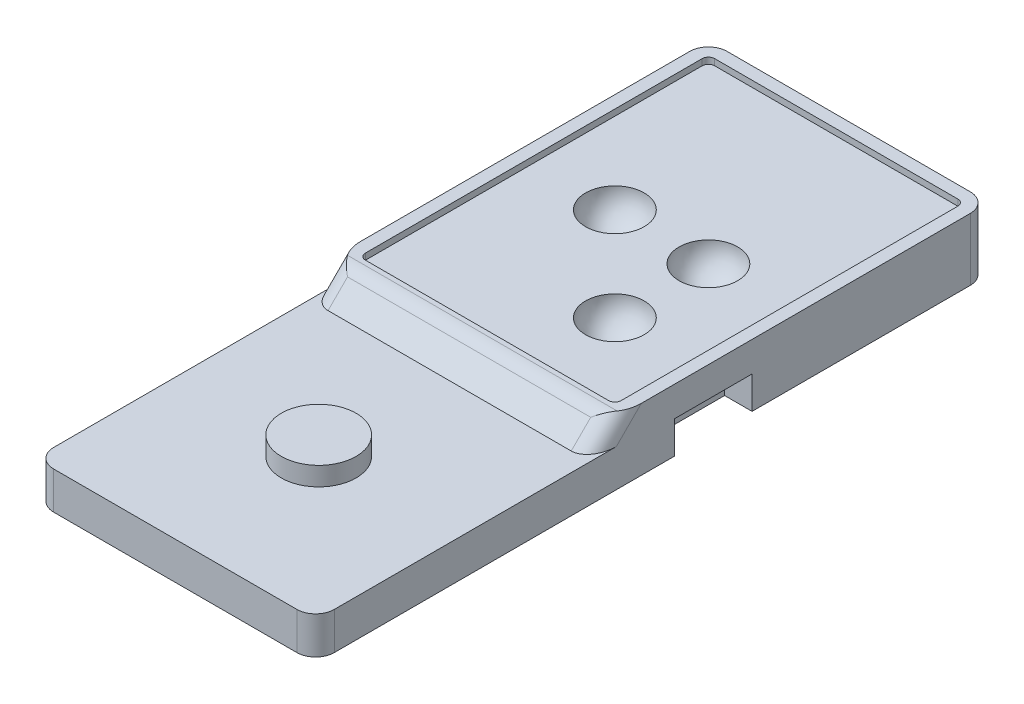
ISO-10303-21;
HEADER;
FILE_DESCRIPTION(('STEP AP214'),'2;1');
FILE_NAME('part.step','',(''),(''),'','','');
FILE_SCHEMA(('AUTOMOTIVE_DESIGN { 1 0 10303 214 1 1 1 1 }'));
ENDSEC;
DATA;
#1=APPLICATION_CONTEXT('core data for automotive mechanical design processes');
#2=APPLICATION_PROTOCOL_DEFINITION('international standard','automotive_design',2000,#1);
#3=PRODUCT_CONTEXT('',#1,'mechanical');
#4=PRODUCT('Part','Part','',(#3));
#5=PRODUCT_RELATED_PRODUCT_CATEGORY('part','',(#4));
#6=PRODUCT_DEFINITION_FORMATION('','',#4);
#7=PRODUCT_DEFINITION_CONTEXT('part definition',#1,'design');
#8=PRODUCT_DEFINITION('design','',#6,#7);
#9=PRODUCT_DEFINITION_SHAPE('','',#8);
#10=(LENGTH_UNIT() NAMED_UNIT(*) SI_UNIT(.MILLI.,.METRE.));
#11=(NAMED_UNIT(*) PLANE_ANGLE_UNIT() SI_UNIT($,.RADIAN.));
#12=(NAMED_UNIT(*) SI_UNIT($,.STERADIAN.) SOLID_ANGLE_UNIT());
#13=UNCERTAINTY_MEASURE_WITH_UNIT(LENGTH_MEASURE(1.E-05),#10,'distance_accuracy_value','');
#14=(GEOMETRIC_REPRESENTATION_CONTEXT(3) GLOBAL_UNCERTAINTY_ASSIGNED_CONTEXT((#13)) GLOBAL_UNIT_ASSIGNED_CONTEXT((#10,
#11,#12)) REPRESENTATION_CONTEXT('',''));
#15=CARTESIAN_POINT('',(0.,0.,0.));
#16=DIRECTION('',(0.,0.,1.));
#17=DIRECTION('',(1.,0.,0.));
#18=AXIS2_PLACEMENT_3D('',#15,#16,#17);
#19=CARTESIAN_POINT('',(-12.4,-4.5,0.));
#20=DIRECTION('',(-1.,0.,0.));
#21=DIRECTION('',(0.,0.,1.));
#22=AXIS2_PLACEMENT_3D('',#19,#20,#21);
#23=PLANE('',#22);
#24=DIRECTION('',(0.,0.,1.));
#25=VECTOR('',#24,1.);
#26=CARTESIAN_POINT('',(-12.4,-1.5,15.));
#27=LINE('',#26,#25);
#28=CARTESIAN_POINT('',(-12.4,-1.5,14.8786796564404));
#29=VERTEX_POINT('',#28);
#30=CARTESIAN_POINT('',(-12.4,-1.5,37.5));
#31=VERTEX_POINT('',#30);
#32=EDGE_CURVE('E412',#29,#31,#27,.T.);
#33=ORIENTED_EDGE('',*,*,#32,.F.);
#34=DIRECTION('',(0.,0.707106781186547,-0.707106781186549));
#35=VECTOR('',#34,1.);
#36=CARTESIAN_POINT('',(-12.4,4.43933982822018,8.93933982822016));
#37=LINE('',#36,#35);
#38=CARTESIAN_POINT('',(-12.4,0.5,12.8786796564404));
#39=VERTEX_POINT('',#38);
#40=EDGE_CURVE('E253',#29,#39,#37,.T.);
#41=ORIENTED_EDGE('',*,*,#40,.T.);
#42=DIRECTION('',(0.,0.,-1.));
#43=VECTOR('',#42,1.);
#44=CARTESIAN_POINT('',(-12.4,0.5,15.));
#45=LINE('',#44,#43);
#46=CARTESIAN_POINT('',(-12.4,0.5,-13.5));
#47=VERTEX_POINT('',#46);
#48=EDGE_CURVE('E321',#39,#47,#45,.T.);
#49=ORIENTED_EDGE('',*,*,#48,.T.);
#50=DIRECTION('',(0.,1.,0.));
#51=VECTOR('',#50,1.);
#52=CARTESIAN_POINT('',(-12.4,-4.5,-13.5));
#53=LINE('',#52,#51);
#54=CARTESIAN_POINT('',(-12.4,-4.5,-13.5));
#55=VERTEX_POINT('',#54);
#56=EDGE_CURVE('E454',#47,#55,#53,.F.);
#57=ORIENTED_EDGE('',*,*,#56,.T.);
#58=DIRECTION('',(0.,0.,1.));
#59=VECTOR('',#58,1.);
#60=CARTESIAN_POINT('',(-12.4,-4.5,0.));
#61=LINE('',#60,#59);
#62=CARTESIAN_POINT('',(-12.4,-4.5,4.));
#63=VERTEX_POINT('',#62);
#64=EDGE_CURVE('E425',#55,#63,#61,.T.);
#65=ORIENTED_EDGE('',*,*,#64,.T.);
#66=DIRECTION('',(0.,-1.,0.));
#67=VECTOR('',#66,1.);
#68=CARTESIAN_POINT('',(-12.4,-1.9,4.));
#69=LINE('',#68,#67);
#70=CARTESIAN_POINT('',(-12.4,-1.9,4.));
#71=VERTEX_POINT('',#70);
#72=EDGE_CURVE('E366',#71,#63,#69,.T.);
#73=ORIENTED_EDGE('',*,*,#72,.F.);
#74=DIRECTION('',(0.,0.,1.));
#75=VECTOR('',#74,1.);
#76=CARTESIAN_POINT('',(-12.4,-1.9,10.2));
#77=LINE('',#76,#75);
#78=CARTESIAN_POINT('',(-12.4,-1.9,10.2));
#79=VERTEX_POINT('',#78);
#80=EDGE_CURVE('E356',#71,#79,#77,.T.);
#81=ORIENTED_EDGE('',*,*,#80,.T.);
#82=DIRECTION('',(0.,-1.,0.));
#83=VECTOR('',#82,1.);
#84=CARTESIAN_POINT('',(-12.4,-1.9,10.2));
#85=LINE('',#84,#83);
#86=CARTESIAN_POINT('',(-12.4,-4.5,10.2));
#87=VERTEX_POINT('',#86);
#88=EDGE_CURVE('E374',#79,#87,#85,.T.);
#89=ORIENTED_EDGE('',*,*,#88,.T.);
#90=CARTESIAN_POINT('',(-12.4,-4.5,37.5));
#91=VERTEX_POINT('',#90);
#92=EDGE_CURVE('E424',#87,#91,#61,.T.);
#93=ORIENTED_EDGE('',*,*,#92,.T.);
#94=DIRECTION('',(0.,-1.,0.));
#95=VECTOR('',#94,1.);
#96=CARTESIAN_POINT('',(-12.4,-1.5,37.5));
#97=LINE('',#96,#95);
#98=EDGE_CURVE('E451',#91,#31,#97,.F.);
#99=ORIENTED_EDGE('',*,*,#98,.T.);
#100=EDGE_LOOP('',(#33,#41,#49,#57,#65,#73,#81,#89,#93,#99));
#101=FACE_BOUND('',#100,.T.);
#102=ADVANCED_FACE('F37',(#101),#23,.T.);
#103=CARTESIAN_POINT('',(0.,-4.5,0.));
#104=DIRECTION('',(0.,1.,0.));
#105=DIRECTION('',(0.,0.,1.));
#106=AXIS2_PLACEMENT_3D('',#103,#104,#105);
#107=PLANE('',#106);
#108=DIRECTION('',(1.,0.,0.));
#109=VECTOR('',#108,1.);
#110=CARTESIAN_POINT('',(-10.2,-4.5,10.2));
#111=LINE('',#110,#109);
#112=CARTESIAN_POINT('',(-10.2,-4.5,10.2));
#113=VERTEX_POINT('',#112);
#114=EDGE_CURVE('E360',#87,#113,#111,.T.);
#115=ORIENTED_EDGE('',*,*,#114,.T.);
#116=DIRECTION('',(0.,0.,-1.));
#117=VECTOR('',#116,1.);
#118=CARTESIAN_POINT('',(-10.2,-4.5,10.2));
#119=LINE('',#118,#117);
#120=CARTESIAN_POINT('',(-10.2,-4.5,4.));
#121=VERTEX_POINT('',#120);
#122=EDGE_CURVE('E369',#113,#121,#119,.T.);
#123=ORIENTED_EDGE('',*,*,#122,.T.);
#124=DIRECTION('',(-1.,0.,0.));
#125=VECTOR('',#124,1.);
#126=CARTESIAN_POINT('',(-10.2,-4.5,4.));
#127=LINE('',#126,#125);
#128=EDGE_CURVE('E355',#121,#63,#127,.T.);
#129=ORIENTED_EDGE('',*,*,#128,.T.);
#130=ORIENTED_EDGE('',*,*,#64,.F.);
#131=CARTESIAN_POINT('',(-10.9,-4.5,-13.5));
#132=DIRECTION('',(0.,1.,0.));
#133=DIRECTION('',(0.,0.,1.));
#134=AXIS2_PLACEMENT_3D('',#131,#132,#133);
#135=CIRCLE('',#134,1.5);
#136=CARTESIAN_POINT('',(-10.9,-4.5,-15.));
#137=VERTEX_POINT('',#136);
#138=EDGE_CURVE('E446',#55,#137,#135,.F.);
#139=ORIENTED_EDGE('',*,*,#138,.T.);
#140=DIRECTION('',(1.,0.,0.));
#141=VECTOR('',#140,1.);
#142=CARTESIAN_POINT('',(0.,-4.5,-15.));
#143=LINE('',#142,#141);
#144=CARTESIAN_POINT('',(8.6,-4.5,-15.));
#145=VERTEX_POINT('',#144);
#146=EDGE_CURVE('E419',#137,#145,#143,.T.);
#147=ORIENTED_EDGE('',*,*,#146,.T.);
#148=CARTESIAN_POINT('',(8.6,-4.5,-13.5));
#149=DIRECTION('',(0.,1.,0.));
#150=DIRECTION('',(0.,0.,1.));
#151=AXIS2_PLACEMENT_3D('',#148,#149,#150);
#152=CIRCLE('',#151,1.5);
#153=CARTESIAN_POINT('',(10.1,-4.5,-13.5));
#154=VERTEX_POINT('',#153);
#155=EDGE_CURVE('E448',#145,#154,#152,.F.);
#156=ORIENTED_EDGE('',*,*,#155,.T.);
#157=DIRECTION('',(0.,0.,-1.));
#158=VECTOR('',#157,1.);
#159=CARTESIAN_POINT('',(10.1,-4.5,0.));
#160=LINE('',#159,#158);
#161=CARTESIAN_POINT('',(10.1,-4.5,4.));
#162=VERTEX_POINT('',#161);
#163=EDGE_CURVE('E428',#162,#154,#160,.T.);
#164=ORIENTED_EDGE('',*,*,#163,.F.);
#165=DIRECTION('',(1.,0.,0.));
#166=VECTOR('',#165,1.);
#167=CARTESIAN_POINT('',(7.9,-4.5,4.));
#168=LINE('',#167,#166);
#169=CARTESIAN_POINT('',(7.9,-4.5,4.));
#170=VERTEX_POINT('',#169);
#171=EDGE_CURVE('E387',#170,#162,#168,.T.);
#172=ORIENTED_EDGE('',*,*,#171,.F.);
#173=DIRECTION('',(0.,0.,-1.));
#174=VECTOR('',#173,1.);
#175=CARTESIAN_POINT('',(7.9,-4.5,10.2));
#176=LINE('',#175,#174);
#177=CARTESIAN_POINT('',(7.9,-4.5,10.2));
#178=VERTEX_POINT('',#177);
#179=EDGE_CURVE('E399',#178,#170,#176,.T.);
#180=ORIENTED_EDGE('',*,*,#179,.F.);
#181=DIRECTION('',(-1.,0.,0.));
#182=VECTOR('',#181,1.);
#183=CARTESIAN_POINT('',(7.9,-4.5,10.2));
#184=LINE('',#183,#182);
#185=CARTESIAN_POINT('',(10.1,-4.5,10.2));
#186=VERTEX_POINT('',#185);
#187=EDGE_CURVE('E377',#186,#178,#184,.T.);
#188=ORIENTED_EDGE('',*,*,#187,.F.);
#189=CARTESIAN_POINT('',(10.1,-4.5,37.5));
#190=VERTEX_POINT('',#189);
#191=EDGE_CURVE('E429',#190,#186,#160,.T.);
#192=ORIENTED_EDGE('',*,*,#191,.F.);
#193=CARTESIAN_POINT('',(8.6,-4.5,37.5));
#194=DIRECTION('',(0.,1.,0.));
#195=DIRECTION('',(0.,0.,1.));
#196=AXIS2_PLACEMENT_3D('',#193,#194,#195);
#197=CIRCLE('',#196,1.5);
#198=CARTESIAN_POINT('',(8.6,-4.5,39.));
#199=VERTEX_POINT('',#198);
#200=EDGE_CURVE('E444',#190,#199,#197,.F.);
#201=ORIENTED_EDGE('',*,*,#200,.T.);
#202=DIRECTION('',(1.,0.,0.));
#203=VECTOR('',#202,1.);
#204=CARTESIAN_POINT('',(-12.4,-4.5,39.));
#205=LINE('',#204,#203);
#206=CARTESIAN_POINT('',(-10.9,-4.5,39.));
#207=VERTEX_POINT('',#206);
#208=EDGE_CURVE('E406',#207,#199,#205,.T.);
#209=ORIENTED_EDGE('',*,*,#208,.F.);
#210=CARTESIAN_POINT('',(-10.9,-4.5,37.5));
#211=DIRECTION('',(0.,1.,0.));
#212=DIRECTION('',(0.,0.,1.));
#213=AXIS2_PLACEMENT_3D('',#210,#211,#212);
#214=CIRCLE('',#213,1.5);
#215=EDGE_CURVE('E441',#207,#91,#214,.F.);
#216=ORIENTED_EDGE('',*,*,#215,.T.);
#217=ORIENTED_EDGE('',*,*,#92,.F.);
#218=EDGE_LOOP('',(#115,#123,#129,#130,#139,#147,#156,#164,#172,#180,#188,#192,#201,#209,#216,#217));
#219=FACE_BOUND('',#218,.T.);
#220=ADVANCED_FACE('F489',(#219),#107,.F.);
#221=CARTESIAN_POINT('',(0.,-4.5,-15.));
#222=DIRECTION('',(0.,0.,1.));
#223=DIRECTION('',(1.,0.,0.));
#224=AXIS2_PLACEMENT_3D('',#221,#222,#223);
#225=PLANE('',#224);
#226=DIRECTION('',(0.,1.,0.));
#227=VECTOR('',#226,1.);
#228=CARTESIAN_POINT('',(-10.9,0.,-15.));
#229=LINE('',#228,#227);
#230=CARTESIAN_POINT('',(-10.9,0.5,-15.));
#231=VERTEX_POINT('',#230);
#232=EDGE_CURVE('E437',#137,#231,#229,.T.);
#233=ORIENTED_EDGE('',*,*,#232,.T.);
#234=DIRECTION('',(1.,0.,0.));
#235=VECTOR('',#234,1.);
#236=CARTESIAN_POINT('',(8.6,0.5,-15.));
#237=LINE('',#236,#235);
#238=CARTESIAN_POINT('',(8.6,0.5,-15.));
#239=VERTEX_POINT('',#238);
#240=EDGE_CURVE('E315',#231,#239,#237,.T.);
#241=ORIENTED_EDGE('',*,*,#240,.T.);
#242=DIRECTION('',(0.,1.,0.));
#243=VECTOR('',#242,1.);
#244=CARTESIAN_POINT('',(8.6,-4.5,-15.));
#245=LINE('',#244,#243);
#246=EDGE_CURVE('E439',#239,#145,#245,.F.);
#247=ORIENTED_EDGE('',*,*,#246,.T.);
#248=ORIENTED_EDGE('',*,*,#146,.F.);
#249=EDGE_LOOP('',(#233,#241,#247,#248));
#250=FACE_BOUND('',#249,.T.);
#251=ADVANCED_FACE('F486',(#250),#225,.F.);
#252=CARTESIAN_POINT('',(10.1,-4.5,0.));
#253=DIRECTION('',(1.,0.,0.));
#254=DIRECTION('',(0.,0.,-1.));
#255=AXIS2_PLACEMENT_3D('',#252,#253,#254);
#256=PLANE('',#255);
#257=DIRECTION('',(0.,0.,1.));
#258=VECTOR('',#257,1.);
#259=CARTESIAN_POINT('',(10.1,0.5,15.));
#260=LINE('',#259,#258);
#261=CARTESIAN_POINT('',(10.1,0.5,-13.5));
#262=VERTEX_POINT('',#261);
#263=CARTESIAN_POINT('',(10.1,0.5,12.8786796564404));
#264=VERTEX_POINT('',#263);
#265=EDGE_CURVE('E309',#262,#264,#260,.T.);
#266=ORIENTED_EDGE('',*,*,#265,.T.);
#267=DIRECTION('',(0.,0.707106781186547,-0.707106781186549));
#268=VECTOR('',#267,1.);
#269=CARTESIAN_POINT('',(10.1,4.43933982822018,8.93933982822016));
#270=LINE('',#269,#268);
#271=CARTESIAN_POINT('',(10.1,-1.5,14.8786796564404));
#272=VERTEX_POINT('',#271);
#273=EDGE_CURVE('E251',#264,#272,#270,.F.);
#274=ORIENTED_EDGE('',*,*,#273,.T.);
#275=DIRECTION('',(0.,0.,-1.));
#276=VECTOR('',#275,1.);
#277=CARTESIAN_POINT('',(10.1,-1.5,15.));
#278=LINE('',#277,#276);
#279=CARTESIAN_POINT('',(10.1,-1.5,37.5));
#280=VERTEX_POINT('',#279);
#281=EDGE_CURVE('E417',#280,#272,#278,.T.);
#282=ORIENTED_EDGE('',*,*,#281,.F.);
#283=DIRECTION('',(0.,-1.,0.));
#284=VECTOR('',#283,1.);
#285=CARTESIAN_POINT('',(10.1,-4.5,37.5));
#286=LINE('',#285,#284);
#287=EDGE_CURVE('E432',#280,#190,#286,.T.);
#288=ORIENTED_EDGE('',*,*,#287,.T.);
#289=ORIENTED_EDGE('',*,*,#191,.T.);
#290=DIRECTION('',(0.,-1.,0.));
#291=VECTOR('',#290,1.);
#292=CARTESIAN_POINT('',(10.1,-1.9,10.2));
#293=LINE('',#292,#291);
#294=CARTESIAN_POINT('',(10.1,-1.9,10.2));
#295=VERTEX_POINT('',#294);
#296=EDGE_CURVE('E396',#295,#186,#293,.T.);
#297=ORIENTED_EDGE('',*,*,#296,.F.);
#298=DIRECTION('',(0.,0.,1.));
#299=VECTOR('',#298,1.);
#300=CARTESIAN_POINT('',(10.1,-1.9,10.2));
#301=LINE('',#300,#299);
#302=CARTESIAN_POINT('',(10.1,-1.9,4.));
#303=VERTEX_POINT('',#302);
#304=EDGE_CURVE('E383',#303,#295,#301,.T.);
#305=ORIENTED_EDGE('',*,*,#304,.F.);
#306=DIRECTION('',(0.,-1.,0.));
#307=VECTOR('',#306,1.);
#308=CARTESIAN_POINT('',(10.1,-1.9,4.));
#309=LINE('',#308,#307);
#310=EDGE_CURVE('E403',#303,#162,#309,.T.);
#311=ORIENTED_EDGE('',*,*,#310,.T.);
#312=ORIENTED_EDGE('',*,*,#163,.T.);
#313=DIRECTION('',(0.,1.,0.));
#314=VECTOR('',#313,1.);
#315=CARTESIAN_POINT('',(10.1,0.,-13.5));
#316=LINE('',#315,#314);
#317=EDGE_CURVE('E435',#154,#262,#316,.T.);
#318=ORIENTED_EDGE('',*,*,#317,.T.);
#319=EDGE_LOOP('',(#266,#274,#282,#288,#289,#297,#305,#311,#312,#318));
#320=FACE_BOUND('',#319,.T.);
#321=ADVANCED_FACE('F477',(#320),#256,.T.);
#322=CARTESIAN_POINT('',(0.,0.,0.));
#323=DIRECTION('',(0.,1.,0.));
#324=DIRECTION('',(0.,0.,1.));
#325=AXIS2_PLACEMENT_3D('',#322,#323,#324);
#326=PLANE('',#325);
#327=CARTESIAN_POINT('',(2.6,0.,0.));
#328=DIRECTION('',(0.,1.,0.));
#329=DIRECTION('',(0.,0.,1.));
#330=AXIS2_PLACEMENT_3D('',#327,#328,#329);
#331=CIRCLE('',#330,2.35);
#332=CARTESIAN_POINT('',(2.6,0.,2.35));
#333=VERTEX_POINT('',#332);
#334=EDGE_CURVE('E41',#333,#333,#331,.T.);
#335=ORIENTED_EDGE('',*,*,#334,.F.);
#336=EDGE_LOOP('',(#335));
#337=FACE_BOUND('',#336,.T.);
#338=CARTESIAN_POINT('',(2.6,0.,7.5));
#339=DIRECTION('',(0.,1.,0.));
#340=DIRECTION('',(0.,0.,1.));
#341=AXIS2_PLACEMENT_3D('',#338,#339,#340);
#342=CIRCLE('',#341,2.35);
#343=CARTESIAN_POINT('',(2.6,0.,9.85));
#344=VERTEX_POINT('',#343);
#345=EDGE_CURVE('E284',#344,#344,#342,.T.);
#346=ORIENTED_EDGE('',*,*,#345,.F.);
#347=EDGE_LOOP('',(#346));
#348=FACE_BOUND('',#347,.T.);
#349=CARTESIAN_POINT('',(-4.89999999999999,0.,0.));
#350=DIRECTION('',(0.,1.,0.));
#351=DIRECTION('',(0.,0.,1.));
#352=AXIS2_PLACEMENT_3D('',#349,#350,#351);
#353=CIRCLE('',#352,2.35);
#354=CARTESIAN_POINT('',(-4.89999999999999,0.,2.35));
#355=VERTEX_POINT('',#354);
#356=EDGE_CURVE('E245',#355,#355,#353,.T.);
#357=ORIENTED_EDGE('',*,*,#356,.F.);
#358=EDGE_LOOP('',(#357));
#359=FACE_BOUND('',#358,.T.);
#360=DIRECTION('',(0.,0.,-1.));
#361=VECTOR('',#360,1.);
#362=CARTESIAN_POINT('',(-11.4,0.,15.));
#363=LINE('',#362,#361);
#364=CARTESIAN_POINT('',(-11.4,0.,13.5));
#365=VERTEX_POINT('',#364);
#366=CARTESIAN_POINT('',(-11.4,0.,-13.5));
#367=VERTEX_POINT('',#366);
#368=EDGE_CURVE('E334',#365,#367,#363,.T.);
#369=ORIENTED_EDGE('',*,*,#368,.F.);
#370=CARTESIAN_POINT('',(-10.9,0.,13.5));
#371=DIRECTION('',(0.,1.,0.));
#372=DIRECTION('',(0.,0.,1.));
#373=AXIS2_PLACEMENT_3D('',#370,#371,#372);
#374=CIRCLE('',#373,0.5);
#375=CARTESIAN_POINT('',(-10.9,0.,14.));
#376=VERTEX_POINT('',#375);
#377=EDGE_CURVE('E271',#365,#376,#374,.T.);
#378=ORIENTED_EDGE('',*,*,#377,.T.);
#379=DIRECTION('',(-1.,0.,0.));
#380=VECTOR('',#379,1.);
#381=CARTESIAN_POINT('',(0.,0.,14.));
#382=LINE('',#381,#380);
#383=CARTESIAN_POINT('',(8.6,0.,14.));
#384=VERTEX_POINT('',#383);
#385=EDGE_CURVE('E304',#384,#376,#382,.T.);
#386=ORIENTED_EDGE('',*,*,#385,.F.);
#387=CARTESIAN_POINT('',(8.6,0.,13.5));
#388=DIRECTION('',(0.,1.,0.));
#389=DIRECTION('',(0.,0.,1.));
#390=AXIS2_PLACEMENT_3D('',#387,#388,#389);
#391=CIRCLE('',#390,0.5);
#392=CARTESIAN_POINT('',(9.1,0.,13.5));
#393=VERTEX_POINT('',#392);
#394=EDGE_CURVE('E269',#384,#393,#391,.T.);
#395=ORIENTED_EDGE('',*,*,#394,.T.);
#396=DIRECTION('',(0.,0.,-1.));
#397=VECTOR('',#396,1.);
#398=CARTESIAN_POINT('',(9.1,0.,15.));
#399=LINE('',#398,#397);
#400=CARTESIAN_POINT('',(9.1,0.,-13.5));
#401=VERTEX_POINT('',#400);
#402=EDGE_CURVE('E307',#401,#393,#399,.F.);
#403=ORIENTED_EDGE('',*,*,#402,.F.);
#404=CARTESIAN_POINT('',(8.6,0.,-13.5));
#405=DIRECTION('',(0.,1.,0.));
#406=DIRECTION('',(1.,0.,0.));
#407=AXIS2_PLACEMENT_3D('',#404,#405,#406);
#408=CIRCLE('',#407,0.500000000000001);
#409=CARTESIAN_POINT('',(8.6,0.,-14.));
#410=VERTEX_POINT('',#409);
#411=EDGE_CURVE('E310',#410,#401,#408,.F.);
#412=ORIENTED_EDGE('',*,*,#411,.F.);
#413=DIRECTION('',(1.,0.,0.));
#414=VECTOR('',#413,1.);
#415=CARTESIAN_POINT('',(8.6,0.,-14.));
#416=LINE('',#415,#414);
#417=CARTESIAN_POINT('',(-10.9,0.,-14.));
#418=VERTEX_POINT('',#417);
#419=EDGE_CURVE('E339',#418,#410,#416,.T.);
#420=ORIENTED_EDGE('',*,*,#419,.F.);
#421=CARTESIAN_POINT('',(-10.9,0.,-13.5));
#422=DIRECTION('',(0.,1.,0.));
#423=DIRECTION('',(1.,0.,0.));
#424=AXIS2_PLACEMENT_3D('',#421,#422,#423);
#425=CIRCLE('',#424,0.500000000000001);
#426=EDGE_CURVE('E336',#367,#418,#425,.F.);
#427=ORIENTED_EDGE('',*,*,#426,.F.);
#428=EDGE_LOOP('',(#369,#378,#386,#395,#403,#412,#420,#427));
#429=FACE_BOUND('',#428,.T.);
#430=ADVANCED_FACE('F597',(#337,#348,#359,#429),#326,.T.);
#431=CARTESIAN_POINT('',(-12.4,-1.5,39.));
#432=DIRECTION('',(0.,0.,-1.));
#433=DIRECTION('',(-1.,0.,0.));
#434=AXIS2_PLACEMENT_3D('',#431,#432,#433);
#435=PLANE('',#434);
#436=ORIENTED_EDGE('',*,*,#208,.T.);
#437=DIRECTION('',(0.,-1.,0.));
#438=VECTOR('',#437,1.);
#439=CARTESIAN_POINT('',(8.6,-1.5,39.));
#440=LINE('',#439,#438);
#441=CARTESIAN_POINT('',(8.6,-1.5,39.));
#442=VERTEX_POINT('',#441);
#443=EDGE_CURVE('E459',#199,#442,#440,.F.);
#444=ORIENTED_EDGE('',*,*,#443,.T.);
#445=DIRECTION('',(1.,0.,0.));
#446=VECTOR('',#445,1.);
#447=CARTESIAN_POINT('',(-12.4,-1.5,39.));
#448=LINE('',#447,#446);
#449=CARTESIAN_POINT('',(-10.9,-1.5,39.));
#450=VERTEX_POINT('',#449);
#451=EDGE_CURVE('E414',#450,#442,#448,.T.);
#452=ORIENTED_EDGE('',*,*,#451,.F.);
#453=DIRECTION('',(0.,-1.,0.));
#454=VECTOR('',#453,1.);
#455=CARTESIAN_POINT('',(-10.9,-4.5,39.));
#456=LINE('',#455,#454);
#457=EDGE_CURVE('E456',#450,#207,#456,.T.);
#458=ORIENTED_EDGE('',*,*,#457,.T.);
#459=EDGE_LOOP('',(#436,#444,#452,#458));
#460=FACE_BOUND('',#459,.T.);
#461=ADVANCED_FACE('F510',(#460),#435,.F.);
#462=CARTESIAN_POINT('',(0.,-1.5,0.));
#463=DIRECTION('',(0.,1.,0.));
#464=DIRECTION('',(0.,0.,1.));
#465=AXIS2_PLACEMENT_3D('',#462,#463,#464);
#466=PLANE('',#465);
#467=CARTESIAN_POINT('',(-1.15,-1.5,27.5));
#468=DIRECTION('',(0.,1.,0.));
#469=DIRECTION('',(0.,0.,1.));
#470=AXIS2_PLACEMENT_3D('',#467,#468,#469);
#471=CIRCLE('',#470,3.);
#472=CARTESIAN_POINT('',(-1.15,-1.5,30.5));
#473=VERTEX_POINT('',#472);
#474=EDGE_CURVE('E291',#473,#473,#471,.T.);
#475=ORIENTED_EDGE('',*,*,#474,.F.);
#476=EDGE_LOOP('',(#475));
#477=FACE_BOUND('',#476,.T.);
#478=ORIENTED_EDGE('',*,*,#32,.T.);
#479=CARTESIAN_POINT('',(-10.9,-1.5,37.5));
#480=DIRECTION('',(0.,1.,0.));
#481=DIRECTION('',(0.,0.,1.));
#482=AXIS2_PLACEMENT_3D('',#479,#480,#481);
#483=CIRCLE('',#482,1.5);
#484=EDGE_CURVE('E461',#31,#450,#483,.T.);
#485=ORIENTED_EDGE('',*,*,#484,.T.);
#486=ORIENTED_EDGE('',*,*,#451,.T.);
#487=CARTESIAN_POINT('',(8.6,-1.5,37.5));
#488=DIRECTION('',(0.,1.,0.));
#489=DIRECTION('',(0.,0.,1.));
#490=AXIS2_PLACEMENT_3D('',#487,#488,#489);
#491=CIRCLE('',#490,1.5);
#492=EDGE_CURVE('E463',#442,#280,#491,.T.);
#493=ORIENTED_EDGE('',*,*,#492,.T.);
#494=ORIENTED_EDGE('',*,*,#281,.T.);
#495=CARTESIAN_POINT('',(8.6,-1.5,14.8786796564404));
#496=DIRECTION('',(0.,1.,0.));
#497=DIRECTION('',(0.,0.,-1.));
#498=AXIS2_PLACEMENT_3D('',#495,#496,#497);
#499=ELLIPSE('',#498,2.12132034355965,1.5);
#500=CARTESIAN_POINT('',(8.6,-1.5,17.));
#501=VERTEX_POINT('',#500);
#502=EDGE_CURVE('E261',#272,#501,#499,.F.);
#503=ORIENTED_EDGE('',*,*,#502,.T.);
#504=DIRECTION('',(-1.,0.,0.));
#505=VECTOR('',#504,1.);
#506=CARTESIAN_POINT('',(13.705551275464,-1.5,17.));
#507=LINE('',#506,#505);
#508=CARTESIAN_POINT('',(-10.9,-1.5,17.));
#509=VERTEX_POINT('',#508);
#510=EDGE_CURVE('E235',#501,#509,#507,.T.);
#511=ORIENTED_EDGE('',*,*,#510,.T.);
#512=CARTESIAN_POINT('',(-10.9,-1.5,14.8786796564404));
#513=DIRECTION('',(0.,1.,0.));
#514=DIRECTION('',(0.,0.,-1.));
#515=AXIS2_PLACEMENT_3D('',#512,#513,#514);
#516=ELLIPSE('',#515,2.12132034355965,1.5);
#517=EDGE_CURVE('E263',#509,#29,#516,.F.);
#518=ORIENTED_EDGE('',*,*,#517,.T.);
#519=EDGE_LOOP('',(#478,#485,#486,#493,#494,#503,#511,#518));
#520=FACE_BOUND('',#519,.T.);
#521=ADVANCED_FACE('F471',(#477,#520),#466,.T.);
#522=CARTESIAN_POINT('',(8.6,-4.5,-13.5));
#523=DIRECTION('',(0.,-1.,0.));
#524=DIRECTION('',(0.,0.,-1.));
#525=AXIS2_PLACEMENT_3D('',#522,#523,#524);
#526=CYLINDRICAL_SURFACE('',#525,1.5);
#527=ORIENTED_EDGE('',*,*,#155,.F.);
#528=ORIENTED_EDGE('',*,*,#246,.F.);
#529=CARTESIAN_POINT('',(8.6,0.5,-13.5));
#530=DIRECTION('',(0.,-1.,0.));
#531=DIRECTION('',(0.,0.,1.));
#532=AXIS2_PLACEMENT_3D('',#529,#530,#531);
#533=CIRCLE('',#532,1.5);
#534=EDGE_CURVE('E312',#239,#262,#533,.T.);
#535=ORIENTED_EDGE('',*,*,#534,.T.);
#536=ORIENTED_EDGE('',*,*,#317,.F.);
#537=EDGE_LOOP('',(#527,#528,#535,#536));
#538=FACE_BOUND('',#537,.T.);
#539=ADVANCED_FACE('F483',(#538),#526,.T.);
#540=CARTESIAN_POINT('',(-10.9,-4.5,-13.5));
#541=DIRECTION('',(0.,-1.,0.));
#542=DIRECTION('',(0.,0.,-1.));
#543=AXIS2_PLACEMENT_3D('',#540,#541,#542);
#544=CYLINDRICAL_SURFACE('',#543,1.5);
#545=ORIENTED_EDGE('',*,*,#138,.F.);
#546=ORIENTED_EDGE('',*,*,#56,.F.);
#547=CARTESIAN_POINT('',(-10.9,0.5,-13.5));
#548=DIRECTION('',(0.,-1.,0.));
#549=DIRECTION('',(0.,0.,-1.));
#550=AXIS2_PLACEMENT_3D('',#547,#548,#549);
#551=CIRCLE('',#550,1.5);
#552=EDGE_CURVE('E318',#47,#231,#551,.T.);
#553=ORIENTED_EDGE('',*,*,#552,.T.);
#554=ORIENTED_EDGE('',*,*,#232,.F.);
#555=EDGE_LOOP('',(#545,#546,#553,#554));
#556=FACE_BOUND('',#555,.T.);
#557=ADVANCED_FACE('F495',(#556),#544,.T.);
#558=CARTESIAN_POINT('',(8.6,-4.5,37.5));
#559=DIRECTION('',(0.,1.,0.));
#560=DIRECTION('',(0.,0.,1.));
#561=AXIS2_PLACEMENT_3D('',#558,#559,#560);
#562=CYLINDRICAL_SURFACE('',#561,1.5);
#563=ORIENTED_EDGE('',*,*,#492,.F.);
#564=ORIENTED_EDGE('',*,*,#443,.F.);
#565=ORIENTED_EDGE('',*,*,#200,.F.);
#566=ORIENTED_EDGE('',*,*,#287,.F.);
#567=EDGE_LOOP('',(#563,#564,#565,#566));
#568=FACE_BOUND('',#567,.T.);
#569=ADVANCED_FACE('F515',(#568),#562,.T.);
#570=CARTESIAN_POINT('',(-10.9,-1.5,37.5));
#571=DIRECTION('',(0.,1.,0.));
#572=DIRECTION('',(0.,0.,1.));
#573=AXIS2_PLACEMENT_3D('',#570,#571,#572);
#574=CYLINDRICAL_SURFACE('',#573,1.5);
#575=ORIENTED_EDGE('',*,*,#484,.F.);
#576=ORIENTED_EDGE('',*,*,#98,.F.);
#577=ORIENTED_EDGE('',*,*,#215,.F.);
#578=ORIENTED_EDGE('',*,*,#457,.F.);
#579=EDGE_LOOP('',(#575,#576,#577,#578));
#580=FACE_BOUND('',#579,.T.);
#581=ADVANCED_FACE('F507',(#580),#574,.T.);
#582=CARTESIAN_POINT('',(7.9,-1.9,4.));
#583=DIRECTION('',(0.,0.,-1.));
#584=DIRECTION('',(-1.,0.,0.));
#585=AXIS2_PLACEMENT_3D('',#582,#583,#584);
#586=PLANE('',#585);
#587=ORIENTED_EDGE('',*,*,#171,.T.);
#588=ORIENTED_EDGE('',*,*,#310,.F.);
#589=DIRECTION('',(1.,0.,0.));
#590=VECTOR('',#589,1.);
#591=CARTESIAN_POINT('',(7.9,-1.9,4.));
#592=LINE('',#591,#590);
#593=CARTESIAN_POINT('',(7.9,-1.9,4.));
#594=VERTEX_POINT('',#593);
#595=EDGE_CURVE('E393',#594,#303,#592,.T.);
#596=ORIENTED_EDGE('',*,*,#595,.F.);
#597=DIRECTION('',(0.,-1.,0.));
#598=VECTOR('',#597,1.);
#599=CARTESIAN_POINT('',(7.9,-1.9,4.));
#600=LINE('',#599,#598);
#601=EDGE_CURVE('E407',#594,#170,#600,.T.);
#602=ORIENTED_EDGE('',*,*,#601,.T.);
#603=EDGE_LOOP('',(#587,#588,#596,#602));
#604=FACE_BOUND('',#603,.T.);
#605=ADVANCED_FACE('F529',(#604),#586,.F.);
#606=CARTESIAN_POINT('',(7.9,-1.9,10.2));
#607=DIRECTION('',(-1.,0.,0.));
#608=DIRECTION('',(0.,0.,1.));
#609=AXIS2_PLACEMENT_3D('',#606,#607,#608);
#610=PLANE('',#609);
#611=ORIENTED_EDGE('',*,*,#179,.T.);
#612=ORIENTED_EDGE('',*,*,#601,.F.);
#613=DIRECTION('',(0.,0.,-1.));
#614=VECTOR('',#613,1.);
#615=CARTESIAN_POINT('',(7.9,-1.9,10.2));
#616=LINE('',#615,#614);
#617=CARTESIAN_POINT('',(7.9,-1.9,10.2));
#618=VERTEX_POINT('',#617);
#619=EDGE_CURVE('E390',#618,#594,#616,.T.);
#620=ORIENTED_EDGE('',*,*,#619,.F.);
#621=DIRECTION('',(0.,-1.,0.));
#622=VECTOR('',#621,1.);
#623=CARTESIAN_POINT('',(7.9,-1.9,10.2));
#624=LINE('',#623,#622);
#625=EDGE_CURVE('E409',#618,#178,#624,.T.);
#626=ORIENTED_EDGE('',*,*,#625,.T.);
#627=EDGE_LOOP('',(#611,#612,#620,#626));
#628=FACE_BOUND('',#627,.T.);
#629=ADVANCED_FACE('F523',(#628),#610,.F.);
#630=CARTESIAN_POINT('',(7.9,-1.9,10.2));
#631=DIRECTION('',(0.,0.,1.));
#632=DIRECTION('',(1.,0.,0.));
#633=AXIS2_PLACEMENT_3D('',#630,#631,#632);
#634=PLANE('',#633);
#635=ORIENTED_EDGE('',*,*,#187,.T.);
#636=ORIENTED_EDGE('',*,*,#625,.F.);
#637=DIRECTION('',(-1.,0.,0.));
#638=VECTOR('',#637,1.);
#639=CARTESIAN_POINT('',(7.9,-1.9,10.2));
#640=LINE('',#639,#638);
#641=EDGE_CURVE('E386',#295,#618,#640,.T.);
#642=ORIENTED_EDGE('',*,*,#641,.F.);
#643=ORIENTED_EDGE('',*,*,#296,.T.);
#644=EDGE_LOOP('',(#635,#636,#642,#643));
#645=FACE_BOUND('',#644,.T.);
#646=ADVANCED_FACE('F519',(#645),#634,.F.);
#647=CARTESIAN_POINT('',(0.,-1.9,0.));
#648=DIRECTION('',(0.,-1.,0.));
#649=DIRECTION('',(0.,0.,-1.));
#650=AXIS2_PLACEMENT_3D('',#647,#648,#649);
#651=PLANE('',#650);
#652=ORIENTED_EDGE('',*,*,#304,.T.);
#653=ORIENTED_EDGE('',*,*,#641,.T.);
#654=ORIENTED_EDGE('',*,*,#619,.T.);
#655=ORIENTED_EDGE('',*,*,#595,.T.);
#656=EDGE_LOOP('',(#652,#653,#654,#655));
#657=FACE_BOUND('',#656,.T.);
#658=ADVANCED_FACE('F527',(#657),#651,.T.);
#659=CARTESIAN_POINT('',(-10.2,-1.9,10.2));
#660=DIRECTION('',(0.,0.,-1.));
#661=DIRECTION('',(-1.,0.,0.));
#662=AXIS2_PLACEMENT_3D('',#659,#660,#661);
#663=PLANE('',#662);
#664=ORIENTED_EDGE('',*,*,#114,.F.);
#665=ORIENTED_EDGE('',*,*,#88,.F.);
#666=DIRECTION('',(1.,0.,0.));
#667=VECTOR('',#666,1.);
#668=CARTESIAN_POINT('',(-10.2,-1.9,10.2));
#669=LINE('',#668,#667);
#670=CARTESIAN_POINT('',(-10.2,-1.9,10.2));
#671=VERTEX_POINT('',#670);
#672=EDGE_CURVE('E364',#79,#671,#669,.T.);
#673=ORIENTED_EDGE('',*,*,#672,.T.);
#674=DIRECTION('',(0.,-1.,0.));
#675=VECTOR('',#674,1.);
#676=CARTESIAN_POINT('',(-10.2,-1.9,10.2));
#677=LINE('',#676,#675);
#678=EDGE_CURVE('E378',#671,#113,#677,.T.);
#679=ORIENTED_EDGE('',*,*,#678,.T.);
#680=EDGE_LOOP('',(#664,#665,#673,#679));
#681=FACE_BOUND('',#680,.T.);
#682=ADVANCED_FACE('F615',(#681),#663,.T.);
#683=CARTESIAN_POINT('',(-10.2,-1.9,10.2));
#684=DIRECTION('',(-1.,0.,0.));
#685=DIRECTION('',(0.,0.,1.));
#686=AXIS2_PLACEMENT_3D('',#683,#684,#685);
#687=PLANE('',#686);
#688=ORIENTED_EDGE('',*,*,#122,.F.);
#689=ORIENTED_EDGE('',*,*,#678,.F.);
#690=DIRECTION('',(0.,0.,-1.));
#691=VECTOR('',#690,1.);
#692=CARTESIAN_POINT('',(-10.2,-1.9,10.2));
#693=LINE('',#692,#691);
#694=CARTESIAN_POINT('',(-10.2,-1.9,4.));
#695=VERTEX_POINT('',#694);
#696=EDGE_CURVE('E362',#671,#695,#693,.T.);
#697=ORIENTED_EDGE('',*,*,#696,.T.);
#698=DIRECTION('',(0.,-1.,0.));
#699=VECTOR('',#698,1.);
#700=CARTESIAN_POINT('',(-10.2,-1.9,4.));
#701=LINE('',#700,#699);
#702=EDGE_CURVE('E380',#695,#121,#701,.T.);
#703=ORIENTED_EDGE('',*,*,#702,.T.);
#704=EDGE_LOOP('',(#688,#689,#697,#703));
#705=FACE_BOUND('',#704,.T.);
#706=ADVANCED_FACE('F619',(#705),#687,.T.);
#707=CARTESIAN_POINT('',(-10.2,-1.9,4.));
#708=DIRECTION('',(0.,0.,1.));
#709=DIRECTION('',(1.,0.,0.));
#710=AXIS2_PLACEMENT_3D('',#707,#708,#709);
#711=PLANE('',#710);
#712=ORIENTED_EDGE('',*,*,#128,.F.);
#713=ORIENTED_EDGE('',*,*,#702,.F.);
#714=DIRECTION('',(-1.,0.,0.));
#715=VECTOR('',#714,1.);
#716=CARTESIAN_POINT('',(-10.2,-1.9,4.));
#717=LINE('',#716,#715);
#718=EDGE_CURVE('E359',#695,#71,#717,.T.);
#719=ORIENTED_EDGE('',*,*,#718,.T.);
#720=ORIENTED_EDGE('',*,*,#72,.T.);
#721=EDGE_LOOP('',(#712,#713,#719,#720));
#722=FACE_BOUND('',#721,.T.);
#723=ADVANCED_FACE('F623',(#722),#711,.T.);
#724=CARTESIAN_POINT('',(-2.29999999999999,-1.9,0.));
#725=DIRECTION('',(0.,-1.,0.));
#726=DIRECTION('',(0.,0.,-1.));
#727=AXIS2_PLACEMENT_3D('',#724,#725,#726);
#728=PLANE('',#727);
#729=ORIENTED_EDGE('',*,*,#80,.F.);
#730=ORIENTED_EDGE('',*,*,#718,.F.);
#731=ORIENTED_EDGE('',*,*,#696,.F.);
#732=ORIENTED_EDGE('',*,*,#672,.F.);
#733=EDGE_LOOP('',(#729,#730,#731,#732));
#734=FACE_BOUND('',#733,.T.);
#735=ADVANCED_FACE('F626',(#734),#728,.T.);
#736=CARTESIAN_POINT('',(9.1,0.5,15.));
#737=DIRECTION('',(1.,0.,0.));
#738=DIRECTION('',(0.,0.,-1.));
#739=AXIS2_PLACEMENT_3D('',#736,#737,#738);
#740=PLANE('',#739);
#741=ORIENTED_EDGE('',*,*,#402,.T.);
#742=DIRECTION('',(0.,1.,0.));
#743=VECTOR('',#742,1.);
#744=CARTESIAN_POINT('',(9.1,0.5,13.5));
#745=LINE('',#744,#743);
#746=CARTESIAN_POINT('',(9.1,0.5,13.5));
#747=VERTEX_POINT('',#746);
#748=EDGE_CURVE('E277',#393,#747,#745,.T.);
#749=ORIENTED_EDGE('',*,*,#748,.T.);
#750=DIRECTION('',(0.,0.,-1.));
#751=VECTOR('',#750,1.);
#752=CARTESIAN_POINT('',(9.1,0.5,15.));
#753=LINE('',#752,#751);
#754=CARTESIAN_POINT('',(9.1,0.5,-13.5));
#755=VERTEX_POINT('',#754);
#756=EDGE_CURVE('E61',#755,#747,#753,.F.);
#757=ORIENTED_EDGE('',*,*,#756,.F.);
#758=DIRECTION('',(0.,-1.,0.));
#759=VECTOR('',#758,1.);
#760=CARTESIAN_POINT('',(9.1,0.5,-13.5));
#761=LINE('',#760,#759);
#762=EDGE_CURVE('E331',#755,#401,#761,.T.);
#763=ORIENTED_EDGE('',*,*,#762,.T.);
#764=EDGE_LOOP('',(#741,#749,#757,#763));
#765=FACE_BOUND('',#764,.T.);
#766=ADVANCED_FACE('F589',(#765),#740,.F.);
#767=CARTESIAN_POINT('',(-11.4,0.5,15.));
#768=DIRECTION('',(-1.,0.,0.));
#769=DIRECTION('',(0.,0.,1.));
#770=AXIS2_PLACEMENT_3D('',#767,#768,#769);
#771=PLANE('',#770);
#772=DIRECTION('',(0.,0.,-1.));
#773=VECTOR('',#772,1.);
#774=CARTESIAN_POINT('',(-11.4,0.5,15.));
#775=LINE('',#774,#773);
#776=CARTESIAN_POINT('',(-11.4,0.5,13.5));
#777=VERTEX_POINT('',#776);
#778=CARTESIAN_POINT('',(-11.4,0.5,-13.5));
#779=VERTEX_POINT('',#778);
#780=EDGE_CURVE('E323',#777,#779,#775,.T.);
#781=ORIENTED_EDGE('',*,*,#780,.F.);
#782=DIRECTION('',(0.,-1.,0.));
#783=VECTOR('',#782,1.);
#784=CARTESIAN_POINT('',(-11.4,0.5,13.5));
#785=LINE('',#784,#783);
#786=EDGE_CURVE('E266',#777,#365,#785,.T.);
#787=ORIENTED_EDGE('',*,*,#786,.T.);
#788=ORIENTED_EDGE('',*,*,#368,.T.);
#789=DIRECTION('',(0.,-1.,0.));
#790=VECTOR('',#789,1.);
#791=CARTESIAN_POINT('',(-11.4,0.5,-13.5));
#792=LINE('',#791,#790);
#793=EDGE_CURVE('E352',#779,#367,#792,.T.);
#794=ORIENTED_EDGE('',*,*,#793,.F.);
#795=EDGE_LOOP('',(#781,#787,#788,#794));
#796=FACE_BOUND('',#795,.T.);
#797=ADVANCED_FACE('F573',(#796),#771,.F.);
#798=CARTESIAN_POINT('',(-10.9,0.5,-13.5));
#799=DIRECTION('',(0.,-1.,0.));
#800=DIRECTION('',(0.,0.,-1.));
#801=AXIS2_PLACEMENT_3D('',#798,#799,#800);
#802=CYLINDRICAL_SURFACE('',#801,0.500000000000001);
#803=ORIENTED_EDGE('',*,*,#426,.T.);
#804=DIRECTION('',(0.,-1.,0.));
#805=VECTOR('',#804,1.);
#806=CARTESIAN_POINT('',(-10.9,0.5,-14.));
#807=LINE('',#806,#805);
#808=CARTESIAN_POINT('',(-10.9,0.5,-14.));
#809=VERTEX_POINT('',#808);
#810=EDGE_CURVE('E349',#809,#418,#807,.T.);
#811=ORIENTED_EDGE('',*,*,#810,.F.);
#812=CARTESIAN_POINT('',(-10.9,0.5,-13.5));
#813=DIRECTION('',(0.,1.,0.));
#814=DIRECTION('',(1.,0.,0.));
#815=AXIS2_PLACEMENT_3D('',#812,#813,#814);
#816=CIRCLE('',#815,0.500000000000001);
#817=EDGE_CURVE('E325',#779,#809,#816,.F.);
#818=ORIENTED_EDGE('',*,*,#817,.F.);
#819=ORIENTED_EDGE('',*,*,#793,.T.);
#820=EDGE_LOOP('',(#803,#811,#818,#819));
#821=FACE_BOUND('',#820,.T.);
#822=ADVANCED_FACE('F579',(#821),#802,.F.);
#823=CARTESIAN_POINT('',(8.6,0.5,-14.));
#824=DIRECTION('',(0.,0.,-1.));
#825=DIRECTION('',(-1.,0.,0.));
#826=AXIS2_PLACEMENT_3D('',#823,#824,#825);
#827=PLANE('',#826);
#828=ORIENTED_EDGE('',*,*,#419,.T.);
#829=DIRECTION('',(0.,-1.,0.));
#830=VECTOR('',#829,1.);
#831=CARTESIAN_POINT('',(8.6,0.5,-14.));
#832=LINE('',#831,#830);
#833=CARTESIAN_POINT('',(8.6,0.5,-14.));
#834=VERTEX_POINT('',#833);
#835=EDGE_CURVE('E346',#834,#410,#832,.T.);
#836=ORIENTED_EDGE('',*,*,#835,.F.);
#837=DIRECTION('',(1.,0.,0.));
#838=VECTOR('',#837,1.);
#839=CARTESIAN_POINT('',(8.6,0.5,-14.));
#840=LINE('',#839,#838);
#841=EDGE_CURVE('E327',#809,#834,#840,.T.);
#842=ORIENTED_EDGE('',*,*,#841,.F.);
#843=ORIENTED_EDGE('',*,*,#810,.T.);
#844=EDGE_LOOP('',(#828,#836,#842,#843));
#845=FACE_BOUND('',#844,.T.);
#846=ADVANCED_FACE('F585',(#845),#827,.F.);
#847=CARTESIAN_POINT('',(8.6,0.5,-13.5));
#848=DIRECTION('',(0.,-1.,0.));
#849=DIRECTION('',(0.,0.,-1.));
#850=AXIS2_PLACEMENT_3D('',#847,#848,#849);
#851=CYLINDRICAL_SURFACE('',#850,0.500000000000001);
#852=ORIENTED_EDGE('',*,*,#411,.T.);
#853=ORIENTED_EDGE('',*,*,#762,.F.);
#854=CARTESIAN_POINT('',(8.6,0.5,-13.5));
#855=DIRECTION('',(0.,1.,0.));
#856=DIRECTION('',(1.,0.,0.));
#857=AXIS2_PLACEMENT_3D('',#854,#855,#856);
#858=CIRCLE('',#857,0.500000000000001);
#859=EDGE_CURVE('E329',#834,#755,#858,.F.);
#860=ORIENTED_EDGE('',*,*,#859,.F.);
#861=ORIENTED_EDGE('',*,*,#835,.T.);
#862=EDGE_LOOP('',(#852,#853,#860,#861));
#863=FACE_BOUND('',#862,.T.);
#864=ADVANCED_FACE('F587',(#863),#851,.F.);
#865=CARTESIAN_POINT('',(8.6,0.5,-13.5));
#866=DIRECTION('',(0.,-1.,0.));
#867=DIRECTION('',(-1.,0.,0.));
#868=AXIS2_PLACEMENT_3D('',#865,#866,#867);
#869=PLANE('',#868);
#870=ORIENTED_EDGE('',*,*,#780,.T.);
#871=ORIENTED_EDGE('',*,*,#817,.T.);
#872=ORIENTED_EDGE('',*,*,#841,.T.);
#873=ORIENTED_EDGE('',*,*,#859,.T.);
#874=ORIENTED_EDGE('',*,*,#756,.T.);
#875=CARTESIAN_POINT('',(8.6,0.5,13.5));
#876=DIRECTION('',(0.,-1.,0.));
#877=DIRECTION('',(0.,0.,-1.));
#878=AXIS2_PLACEMENT_3D('',#875,#876,#877);
#879=CIRCLE('',#878,0.5);
#880=CARTESIAN_POINT('',(8.6,0.5,14.));
#881=VERTEX_POINT('',#880);
#882=EDGE_CURVE('E46',#747,#881,#879,.T.);
#883=ORIENTED_EDGE('',*,*,#882,.T.);
#884=DIRECTION('',(-1.,0.,0.));
#885=VECTOR('',#884,1.);
#886=CARTESIAN_POINT('',(13.705551275464,0.5,14.));
#887=LINE('',#886,#885);
#888=CARTESIAN_POINT('',(-10.9,0.5,14.));
#889=VERTEX_POINT('',#888);
#890=EDGE_CURVE('E301',#881,#889,#887,.T.);
#891=ORIENTED_EDGE('',*,*,#890,.T.);
#892=CARTESIAN_POINT('',(-10.9,0.5,13.5));
#893=DIRECTION('',(0.,-1.,0.));
#894=DIRECTION('',(0.,0.,-1.));
#895=AXIS2_PLACEMENT_3D('',#892,#893,#894);
#896=CIRCLE('',#895,0.5);
#897=EDGE_CURVE('E280',#889,#777,#896,.T.);
#898=ORIENTED_EDGE('',*,*,#897,.T.);
#899=EDGE_LOOP('',(#870,#871,#872,#873,#874,#883,#891,#898));
#900=FACE_BOUND('',#899,.T.);
#901=ORIENTED_EDGE('',*,*,#48,.F.);
#902=CARTESIAN_POINT('',(-10.9,0.5,12.8786796564404));
#903=DIRECTION('',(0.,-1.,0.));
#904=DIRECTION('',(0.,0.,-1.));
#905=AXIS2_PLACEMENT_3D('',#902,#903,#904);
#906=ELLIPSE('',#905,2.12132034355965,1.5);
#907=CARTESIAN_POINT('',(-11.9606601717798,0.5,14.3786796564404));
#908=VERTEX_POINT('',#907);
#909=EDGE_CURVE('E244',#39,#908,#906,.F.);
#910=ORIENTED_EDGE('',*,*,#909,.T.);
#911=DIRECTION('',(-1.,0.,0.));
#912=VECTOR('',#911,1.);
#913=CARTESIAN_POINT('',(10.1,0.5,14.3786796564404));
#914=LINE('',#913,#912);
#915=CARTESIAN_POINT('',(9.66066017177982,0.5,14.3786796564404));
#916=VERTEX_POINT('',#915);
#917=EDGE_CURVE('E53',#916,#908,#914,.T.);
#918=ORIENTED_EDGE('',*,*,#917,.F.);
#919=CARTESIAN_POINT('',(8.6,0.5,12.8786796564404));
#920=DIRECTION('',(0.,-1.,0.));
#921=DIRECTION('',(0.,0.,-1.));
#922=AXIS2_PLACEMENT_3D('',#919,#920,#921);
#923=ELLIPSE('',#922,2.12132034355965,1.5);
#924=EDGE_CURVE('E242',#916,#264,#923,.F.);
#925=ORIENTED_EDGE('',*,*,#924,.T.);
#926=ORIENTED_EDGE('',*,*,#265,.F.);
#927=ORIENTED_EDGE('',*,*,#534,.F.);
#928=ORIENTED_EDGE('',*,*,#240,.F.);
#929=ORIENTED_EDGE('',*,*,#552,.F.);
#930=EDGE_LOOP('',(#901,#910,#918,#925,#926,#927,#928,#929));
#931=FACE_BOUND('',#930,.T.);
#932=ADVANCED_FACE('F240',(#900,#931),#869,.F.);
#933=CARTESIAN_POINT('',(13.705551275464,-1.5,14.));
#934=DIRECTION('',(0.,0.,-1.));
#935=DIRECTION('',(-1.,0.,0.));
#936=AXIS2_PLACEMENT_3D('',#933,#934,#935);
#937=PLANE('',#936);
#938=ORIENTED_EDGE('',*,*,#385,.T.);
#939=DIRECTION('',(0.,-1.,0.));
#940=VECTOR('',#939,1.);
#941=CARTESIAN_POINT('',(-10.9,-1.5,14.));
#942=LINE('',#941,#940);
#943=EDGE_CURVE('E275',#376,#889,#942,.F.);
#944=ORIENTED_EDGE('',*,*,#943,.T.);
#945=ORIENTED_EDGE('',*,*,#890,.F.);
#946=DIRECTION('',(0.,1.,0.));
#947=VECTOR('',#946,1.);
#948=CARTESIAN_POINT('',(8.6,-1.5,14.));
#949=LINE('',#948,#947);
#950=EDGE_CURVE('E273',#881,#384,#949,.F.);
#951=ORIENTED_EDGE('',*,*,#950,.T.);
#952=EDGE_LOOP('',(#938,#944,#945,#951));
#953=FACE_BOUND('',#952,.T.);
#954=ADVANCED_FACE('F594',(#953),#937,.T.);
#955=CARTESIAN_POINT('',(13.705551275464,0.5,15.));
#956=DIRECTION('',(0.,0.707106781186548,0.707106781186546));
#957=DIRECTION('',(0.,-0.707106781186547,0.707106781186549));
#958=AXIS2_PLACEMENT_3D('',#955,#956,#957);
#959=PLANE('',#958);
#960=DIRECTION('',(-1.,0.,0.));
#961=VECTOR('',#960,1.);
#962=CARTESIAN_POINT('',(10.1,0.0606601717798218,15.4393398282202));
#963=LINE('',#962,#961);
#964=CARTESIAN_POINT('',(8.60000000000001,0.0606601717798218,15.4393398282202));
#965=VERTEX_POINT('',#964);
#966=CARTESIAN_POINT('',(-10.9,0.0606601717798218,15.4393398282202));
#967=VERTEX_POINT('',#966);
#968=EDGE_CURVE('E230',#965,#967,#963,.T.);
#969=ORIENTED_EDGE('',*,*,#968,.T.);
#970=DIRECTION('',(0.,0.707106781186547,-0.707106781186549));
#971=VECTOR('',#970,1.);
#972=CARTESIAN_POINT('',(-10.9,0.5,15.));
#973=LINE('',#972,#971);
#974=EDGE_CURVE('E465',#967,#509,#973,.F.);
#975=ORIENTED_EDGE('',*,*,#974,.T.);
#976=ORIENTED_EDGE('',*,*,#510,.F.);
#977=DIRECTION('',(0.,0.707106781186547,-0.707106781186549));
#978=VECTOR('',#977,1.);
#979=CARTESIAN_POINT('',(8.6,0.5,15.));
#980=LINE('',#979,#978);
#981=EDGE_CURVE('E255',#501,#965,#980,.T.);
#982=ORIENTED_EDGE('',*,*,#981,.T.);
#983=EDGE_LOOP('',(#969,#975,#976,#982));
#984=FACE_BOUND('',#983,.T.);
#985=ADVANCED_FACE('F468',(#984),#959,.T.);
#986=CARTESIAN_POINT('',(8.6,-0.560660171779823,13.9393398282202));
#987=DIRECTION('',(0.,0.707106781186547,-0.707106781186549));
#988=DIRECTION('',(0.,0.707106781186549,0.707106781186547));
#989=AXIS2_PLACEMENT_3D('',#986,#987,#988);
#990=CYLINDRICAL_SURFACE('',#989,1.5);
#991=CARTESIAN_POINT('',(8.6,-1.,14.3786796564404));
#992=DIRECTION('',(-0.707106781186547,0.499999999999999,-0.500000000000001));
#993=DIRECTION('',(0.707106781186547,0.499999999999999,-0.500000000000001));
#994=AXIS2_PLACEMENT_3D('',#991,#992,#993);
#995=ELLIPSE('',#994,2.12132034355964,1.5);
#996=EDGE_CURVE('E227',#965,#916,#995,.T.);
#997=ORIENTED_EDGE('',*,*,#996,.F.);
#998=ORIENTED_EDGE('',*,*,#981,.F.);
#999=ORIENTED_EDGE('',*,*,#502,.F.);
#1000=ORIENTED_EDGE('',*,*,#273,.F.);
#1001=ORIENTED_EDGE('',*,*,#924,.F.);
#1002=EDGE_LOOP('',(#997,#998,#999,#1000,#1001));
#1003=FACE_BOUND('',#1002,.T.);
#1004=ADVANCED_FACE('F248',(#1003),#990,.T.);
#1005=CARTESIAN_POINT('',(-10.9,4.43933982822018,8.93933982822016));
#1006=DIRECTION('',(0.,0.707106781186547,-0.707106781186549));
#1007=DIRECTION('',(0.,0.707106781186549,0.707106781186547));
#1008=AXIS2_PLACEMENT_3D('',#1005,#1006,#1007);
#1009=CYLINDRICAL_SURFACE('',#1008,1.5);
#1010=CARTESIAN_POINT('',(-10.9,-1.,14.3786796564404));
#1011=DIRECTION('',(0.707106781186547,0.499999999999999,-0.500000000000001));
#1012=DIRECTION('',(-0.707106781186547,0.499999999999999,-0.500000000000001));
#1013=AXIS2_PLACEMENT_3D('',#1010,#1011,#1012);
#1014=ELLIPSE('',#1013,2.12132034355964,1.5);
#1015=EDGE_CURVE('E11',#908,#967,#1014,.T.);
#1016=ORIENTED_EDGE('',*,*,#1015,.F.);
#1017=ORIENTED_EDGE('',*,*,#909,.F.);
#1018=ORIENTED_EDGE('',*,*,#40,.F.);
#1019=ORIENTED_EDGE('',*,*,#517,.F.);
#1020=ORIENTED_EDGE('',*,*,#974,.F.);
#1021=EDGE_LOOP('',(#1016,#1017,#1018,#1019,#1020));
#1022=FACE_BOUND('',#1021,.T.);
#1023=ADVANCED_FACE('F500',(#1022),#1009,.T.);
#1024=CARTESIAN_POINT('',(-10.9,0.5,13.5));
#1025=DIRECTION('',(0.,-1.,0.));
#1026=DIRECTION('',(0.,0.,-1.));
#1027=AXIS2_PLACEMENT_3D('',#1024,#1025,#1026);
#1028=CYLINDRICAL_SURFACE('',#1027,0.5);
#1029=ORIENTED_EDGE('',*,*,#897,.F.);
#1030=ORIENTED_EDGE('',*,*,#943,.F.);
#1031=ORIENTED_EDGE('',*,*,#377,.F.);
#1032=ORIENTED_EDGE('',*,*,#786,.F.);
#1033=EDGE_LOOP('',(#1029,#1030,#1031,#1032));
#1034=FACE_BOUND('',#1033,.T.);
#1035=ADVANCED_FACE('F559',(#1034),#1028,.F.);
#1036=CARTESIAN_POINT('',(8.6,0.5,13.5));
#1037=DIRECTION('',(0.,1.,0.));
#1038=DIRECTION('',(0.,0.,1.));
#1039=AXIS2_PLACEMENT_3D('',#1036,#1037,#1038);
#1040=CYLINDRICAL_SURFACE('',#1039,0.5);
#1041=ORIENTED_EDGE('',*,*,#394,.F.);
#1042=ORIENTED_EDGE('',*,*,#950,.F.);
#1043=ORIENTED_EDGE('',*,*,#882,.F.);
#1044=ORIENTED_EDGE('',*,*,#748,.F.);
#1045=EDGE_LOOP('',(#1041,#1042,#1043,#1044));
#1046=FACE_BOUND('',#1045,.T.);
#1047=ADVANCED_FACE('F39',(#1046),#1040,.F.);
#1048=CARTESIAN_POINT('',(10.1,-1.,14.3786796564404));
#1049=DIRECTION('',(-1.,0.,0.));
#1050=DIRECTION('',(0.,0.,1.));
#1051=AXIS2_PLACEMENT_3D('',#1048,#1049,#1050);
#1052=CYLINDRICAL_SURFACE('',#1051,1.5);
#1053=ORIENTED_EDGE('',*,*,#996,.T.);
#1054=ORIENTED_EDGE('',*,*,#917,.T.);
#1055=ORIENTED_EDGE('',*,*,#1015,.T.);
#1056=ORIENTED_EDGE('',*,*,#968,.F.);
#1057=EDGE_LOOP('',(#1053,#1054,#1055,#1056));
#1058=FACE_BOUND('',#1057,.T.);
#1059=ADVANCED_FACE('F228',(#1058),#1052,.T.);
#1060=CARTESIAN_POINT('',(-4.89999999999999,0.,0.));
#1061=DIRECTION('',(0.,0.,-1.));
#1062=DIRECTION('',(1.,0.,0.));
#1063=AXIS2_PLACEMENT_3D('',#1060,#1061,#1062);
#1064=SPHERICAL_SURFACE('',#1063,2.35);
#1065=CARTESIAN_POINT('',(-4.89999999999999,0.,0.));
#1066=DIRECTION('',(0.,1.,0.));
#1067=DIRECTION('',(0.,0.,1.));
#1068=AXIS2_PLACEMENT_3D('',#1065,#1066,#1067);
#1069=SPHERICAL_SURFACE('',#1068,2.35);
#1070=ORIENTED_EDGE('',*,*,#356,.T.);
#1071=EDGE_LOOP('',(#1070));
#1072=FACE_BOUND('',#1071,.T.);
#1073=ADVANCED_FACE('F652',(#1072),#1069,.F.);
#1074=CARTESIAN_POINT('',(2.6,0.,7.5));
#1075=DIRECTION('',(0.,0.,1.));
#1076=DIRECTION('',(-1.,0.,0.));
#1077=AXIS2_PLACEMENT_3D('',#1074,#1075,#1076);
#1078=SPHERICAL_SURFACE('',#1077,2.35);
#1079=CARTESIAN_POINT('',(2.6,0.,7.5));
#1080=DIRECTION('',(0.,1.,0.));
#1081=DIRECTION('',(0.,0.,1.));
#1082=AXIS2_PLACEMENT_3D('',#1079,#1080,#1081);
#1083=SPHERICAL_SURFACE('',#1082,2.35);
#1084=ORIENTED_EDGE('',*,*,#345,.T.);
#1085=EDGE_LOOP('',(#1084));
#1086=FACE_BOUND('',#1085,.T.);
#1087=ADVANCED_FACE('F655',(#1086),#1083,.F.);
#1088=CARTESIAN_POINT('',(2.6,0.,0.));
#1089=DIRECTION('',(0.,0.,1.));
#1090=DIRECTION('',(1.,0.,0.));
#1091=AXIS2_PLACEMENT_3D('',#1088,#1089,#1090);
#1092=SPHERICAL_SURFACE('',#1091,2.35);
#1093=CARTESIAN_POINT('',(2.6,0.,0.));
#1094=DIRECTION('',(0.,1.,0.));
#1095=DIRECTION('',(0.,0.,1.));
#1096=AXIS2_PLACEMENT_3D('',#1093,#1094,#1095);
#1097=SPHERICAL_SURFACE('',#1096,2.35);
#1098=ORIENTED_EDGE('',*,*,#334,.T.);
#1099=EDGE_LOOP('',(#1098));
#1100=FACE_BOUND('',#1099,.T.);
#1101=ADVANCED_FACE('F659',(#1100),#1097,.F.);
#1102=CARTESIAN_POINT('',(-1.15,0.,27.5));
#1103=DIRECTION('',(0.,-1.,0.));
#1104=DIRECTION('',(0.,0.,-1.));
#1105=AXIS2_PLACEMENT_3D('',#1102,#1103,#1104);
#1106=CYLINDRICAL_SURFACE('',#1105,3.);
#1107=CARTESIAN_POINT('',(-1.15,0.,27.5));
#1108=DIRECTION('',(0.,1.,0.));
#1109=DIRECTION('',(0.,0.,1.));
#1110=AXIS2_PLACEMENT_3D('',#1107,#1108,#1109);
#1111=CIRCLE('',#1110,3.);
#1112=CARTESIAN_POINT('',(-1.15,0.,30.5));
#1113=VERTEX_POINT('',#1112);
#1114=EDGE_CURVE('E286',#1113,#1113,#1111,.T.);
#1115=ORIENTED_EDGE('',*,*,#1114,.F.);
#1116=EDGE_LOOP('',(#1115));
#1117=FACE_BOUND('',#1116,.T.);
#1118=ORIENTED_EDGE('',*,*,#474,.T.);
#1119=EDGE_LOOP('',(#1118));
#1120=FACE_BOUND('',#1119,.T.);
#1121=ADVANCED_FACE('F662',(#1117,#1120),#1106,.T.);
#1122=CARTESIAN_POINT('',(-1.15,0.,27.5));
#1123=DIRECTION('',(0.,1.,0.));
#1124=DIRECTION('',(0.,0.,1.));
#1125=AXIS2_PLACEMENT_3D('',#1122,#1123,#1124);
#1126=PLANE('',#1125);
#1127=ORIENTED_EDGE('',*,*,#1114,.T.);
#1128=EDGE_LOOP('',(#1127));
#1129=FACE_BOUND('',#1128,.T.);
#1130=ADVANCED_FACE('F666',(#1129),#1126,.T.);
#1131=CLOSED_SHELL('',(#102,#220,#251,#321,#430,#461,#521,#539,#557,#569,#581,#605,#629,#646,
#658,#682,#706,#723,#735,#766,#797,#822,#846,#864,#932,#954,#985,#1004,#1023,#1035,#1047,#1059,
#1073,#1087,#1101,#1121,#1130));
#1132=MANIFOLD_SOLID_BREP('B2',#1131);
#1133=ADVANCED_BREP_SHAPE_REPRESENTATION('',(#18,#1132),#14);
#1134=SHAPE_DEFINITION_REPRESENTATION(#9,#1133);
ENDSEC;
END-ISO-10303-21;
